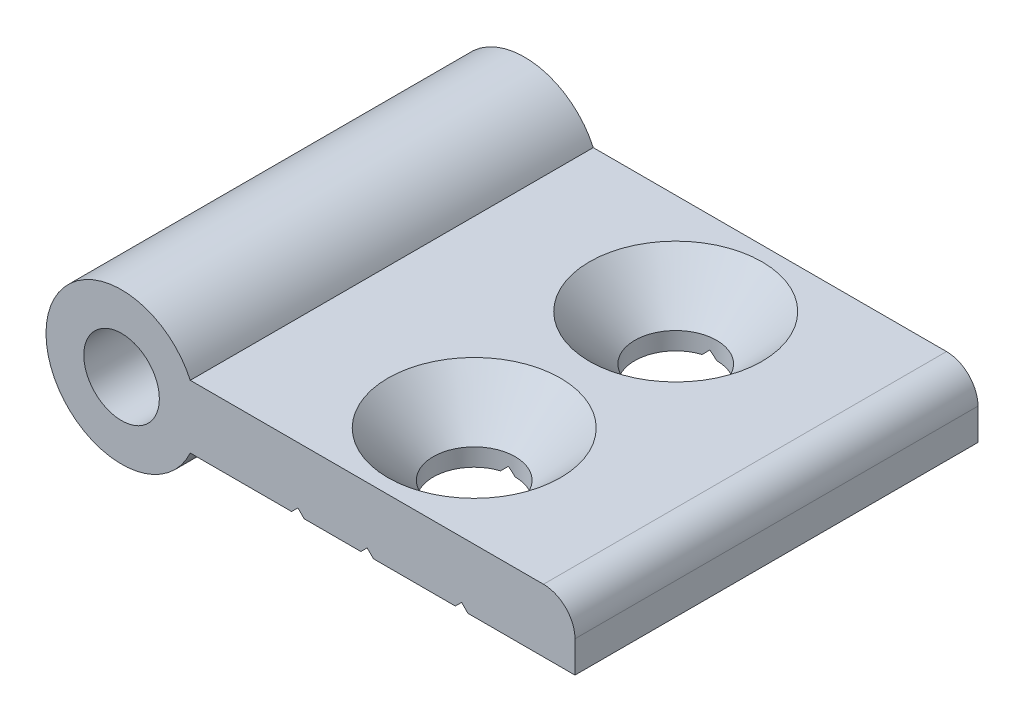
ISO-10303-21;
HEADER;
FILE_DESCRIPTION(('STEP AP214'),'2;1');
FILE_NAME('part.step','',(''),(''),'','','');
FILE_SCHEMA(('AUTOMOTIVE_DESIGN { 1 0 10303 214 1 1 1 1 }'));
ENDSEC;
DATA;
#1=APPLICATION_CONTEXT('core data for automotive mechanical design processes');
#2=APPLICATION_PROTOCOL_DEFINITION('international standard','automotive_design',2000,#1);
#3=PRODUCT_CONTEXT('',#1,'mechanical');
#4=PRODUCT('Part','Part','',(#3));
#5=PRODUCT_RELATED_PRODUCT_CATEGORY('part','',(#4));
#6=PRODUCT_DEFINITION_FORMATION('','',#4);
#7=PRODUCT_DEFINITION_CONTEXT('part definition',#1,'design');
#8=PRODUCT_DEFINITION('design','',#6,#7);
#9=PRODUCT_DEFINITION_SHAPE('','',#8);
#10=(LENGTH_UNIT() NAMED_UNIT(*) SI_UNIT(.MILLI.,.METRE.));
#11=(NAMED_UNIT(*) PLANE_ANGLE_UNIT() SI_UNIT($,.RADIAN.));
#12=(NAMED_UNIT(*) SI_UNIT($,.STERADIAN.) SOLID_ANGLE_UNIT());
#13=UNCERTAINTY_MEASURE_WITH_UNIT(LENGTH_MEASURE(1.E-05),#10,'distance_accuracy_value','');
#14=(GEOMETRIC_REPRESENTATION_CONTEXT(3) GLOBAL_UNCERTAINTY_ASSIGNED_CONTEXT((#13)) GLOBAL_UNIT_ASSIGNED_CONTEXT((#10,
#11,#12)) REPRESENTATION_CONTEXT('',''));
#15=CARTESIAN_POINT('',(0.,0.,0.));
#16=DIRECTION('',(0.,0.,1.));
#17=DIRECTION('',(1.,0.,0.));
#18=AXIS2_PLACEMENT_3D('',#15,#16,#17);
#19=CARTESIAN_POINT('',(19.,-2.5,0.));
#20=DIRECTION('',(0.707106781186547,-0.707106781186548,0.));
#21=DIRECTION('',(0.707106781186548,0.707106781186547,0.));
#22=AXIS2_PLACEMENT_3D('',#19,#20,#21);
#23=PLANE('',#22);
#24=CARTESIAN_POINT('',(20.,-1.5,8.));
#25=DIRECTION('',(0.707106781186547,-0.707106781186548,0.));
#26=DIRECTION('',(-0.707106781186548,-0.707106781186547,0.));
#27=AXIS2_PLACEMENT_3D('',#24,#25,#26);
#28=ELLIPSE('',#27,4.59619407771256,3.25);
#29=CARTESIAN_POINT('',(19.5,-2.,4.78869185533372));
#30=VERTEX_POINT('',#29);
#31=CARTESIAN_POINT('',(19.,-2.5,4.90767078078676));
#32=VERTEX_POINT('',#31);
#33=EDGE_CURVE('E181',#30,#32,#28,.F.);
#34=ORIENTED_EDGE('',*,*,#33,.T.);
#35=DIRECTION('',(0.,0.,-1.));
#36=VECTOR('',#35,1.);
#37=CARTESIAN_POINT('',(19.,-2.5,0.));
#38=LINE('',#37,#36);
#39=CARTESIAN_POINT('',(19.,-2.5,-4.90767078078675));
#40=VERTEX_POINT('',#39);
#41=EDGE_CURVE('E179',#40,#32,#38,.F.);
#42=ORIENTED_EDGE('',*,*,#41,.F.);
#43=CARTESIAN_POINT('',(20.,-1.5,-8.));
#44=DIRECTION('',(0.707106781186547,-0.707106781186548,0.));
#45=DIRECTION('',(-0.707106781186548,-0.707106781186547,0.));
#46=AXIS2_PLACEMENT_3D('',#43,#44,#45);
#47=ELLIPSE('',#46,4.59619407771256,3.25);
#48=CARTESIAN_POINT('',(19.5,-2.,-4.78869185533371));
#49=VERTEX_POINT('',#48);
#50=EDGE_CURVE('E20',#40,#49,#47,.F.);
#51=ORIENTED_EDGE('',*,*,#50,.T.);
#52=DIRECTION('',(0.,0.,1.));
#53=VECTOR('',#52,1.);
#54=CARTESIAN_POINT('',(19.5,-2.,0.));
#55=LINE('',#54,#53);
#56=EDGE_CURVE('E216',#30,#49,#55,.F.);
#57=ORIENTED_EDGE('',*,*,#56,.F.);
#58=EDGE_LOOP('',(#34,#42,#51,#57));
#59=FACE_BOUND('',#58,.T.);
#60=ADVANCED_FACE('F16',(#59),#23,.T.);
#61=CARTESIAN_POINT('',(19.,-2.5,0.));
#62=DIRECTION('',(0.707106781186547,-0.707106781186548,0.));
#63=DIRECTION('',(0.707106781186548,0.707106781186547,0.));
#64=AXIS2_PLACEMENT_3D('',#61,#62,#63);
#65=PLANE('',#64);
#66=DIRECTION('',(0.707106781186548,0.707106781186547,0.));
#67=VECTOR('',#66,1.);
#68=CARTESIAN_POINT('',(19.,-2.5,16.));
#69=LINE('',#68,#67);
#70=CARTESIAN_POINT('',(19.5,-2.,16.));
#71=VERTEX_POINT('',#70);
#72=CARTESIAN_POINT('',(19.,-2.5,16.));
#73=VERTEX_POINT('',#72);
#74=EDGE_CURVE('E329',#71,#73,#69,.F.);
#75=ORIENTED_EDGE('',*,*,#74,.T.);
#76=DIRECTION('',(0.,0.,-1.));
#77=VECTOR('',#76,1.);
#78=CARTESIAN_POINT('',(19.,-2.5,0.));
#79=LINE('',#78,#77);
#80=CARTESIAN_POINT('',(19.,-2.5,11.0923292192132));
#81=VERTEX_POINT('',#80);
#82=EDGE_CURVE('E248',#81,#73,#79,.F.);
#83=ORIENTED_EDGE('',*,*,#82,.F.);
#84=CARTESIAN_POINT('',(20.,-1.5,8.));
#85=DIRECTION('',(0.707106781186547,-0.707106781186548,0.));
#86=DIRECTION('',(-0.707106781186548,-0.707106781186547,0.));
#87=AXIS2_PLACEMENT_3D('',#84,#85,#86);
#88=ELLIPSE('',#87,4.59619407771256,3.25);
#89=CARTESIAN_POINT('',(19.5,-2.,11.2113081446663));
#90=VERTEX_POINT('',#89);
#91=EDGE_CURVE('E204',#81,#90,#88,.F.);
#92=ORIENTED_EDGE('',*,*,#91,.T.);
#93=DIRECTION('',(0.,0.,1.));
#94=VECTOR('',#93,1.);
#95=CARTESIAN_POINT('',(19.5,-2.,0.));
#96=LINE('',#95,#94);
#97=EDGE_CURVE('E289',#71,#90,#96,.F.);
#98=ORIENTED_EDGE('',*,*,#97,.F.);
#99=EDGE_LOOP('',(#75,#83,#92,#98));
#100=FACE_BOUND('',#99,.T.);
#101=ADVANCED_FACE('F513',(#100),#65,.T.);
#102=CARTESIAN_POINT('',(14.,-2.,0.));
#103=DIRECTION('',(-0.707106781186547,-0.707106781186548,0.));
#104=DIRECTION('',(0.707106781186548,-0.707106781186547,0.));
#105=AXIS2_PLACEMENT_3D('',#102,#103,#104);
#106=PLANE('',#105);
#107=DIRECTION('',(0.707106781186548,-0.707106781186547,0.));
#108=VECTOR('',#107,1.);
#109=CARTESIAN_POINT('',(14.,-2.,16.));
#110=LINE('',#109,#108);
#111=CARTESIAN_POINT('',(14.5,-2.5,16.));
#112=VERTEX_POINT('',#111);
#113=CARTESIAN_POINT('',(14.,-2.,16.));
#114=VERTEX_POINT('',#113);
#115=EDGE_CURVE('E323',#112,#114,#110,.F.);
#116=ORIENTED_EDGE('',*,*,#115,.T.);
#117=DIRECTION('',(0.,0.,1.));
#118=VECTOR('',#117,1.);
#119=CARTESIAN_POINT('',(14.,-2.,0.));
#120=LINE('',#119,#118);
#121=CARTESIAN_POINT('',(14.,-2.,-16.));
#122=VERTEX_POINT('',#121);
#123=EDGE_CURVE('E193',#122,#114,#120,.T.);
#124=ORIENTED_EDGE('',*,*,#123,.F.);
#125=DIRECTION('',(0.707106781186548,-0.707106781186547,0.));
#126=VECTOR('',#125,1.);
#127=CARTESIAN_POINT('',(14.,-2.,-16.));
#128=LINE('',#127,#126);
#129=CARTESIAN_POINT('',(14.5,-2.5,-16.));
#130=VERTEX_POINT('',#129);
#131=EDGE_CURVE('E331',#122,#130,#128,.T.);
#132=ORIENTED_EDGE('',*,*,#131,.T.);
#133=DIRECTION('',(0.,0.,-1.));
#134=VECTOR('',#133,1.);
#135=CARTESIAN_POINT('',(14.5,-2.5,0.));
#136=LINE('',#135,#134);
#137=EDGE_CURVE('E245',#112,#130,#136,.T.);
#138=ORIENTED_EDGE('',*,*,#137,.F.);
#139=EDGE_LOOP('',(#116,#124,#132,#138));
#140=FACE_BOUND('',#139,.T.);
#141=ADVANCED_FACE('F545',(#140),#106,.T.);
#142=CARTESIAN_POINT('',(19.,-2.5,0.));
#143=DIRECTION('',(0.707106781186547,-0.707106781186548,0.));
#144=DIRECTION('',(0.707106781186548,0.707106781186547,0.));
#145=AXIS2_PLACEMENT_3D('',#142,#143,#144);
#146=PLANE('',#145);
#147=DIRECTION('',(0.707106781186548,0.707106781186547,0.));
#148=VECTOR('',#147,1.);
#149=CARTESIAN_POINT('',(19.,-2.5,-16.));
#150=LINE('',#149,#148);
#151=CARTESIAN_POINT('',(19.,-2.5,-16.));
#152=VERTEX_POINT('',#151);
#153=CARTESIAN_POINT('',(19.5,-2.,-16.));
#154=VERTEX_POINT('',#153);
#155=EDGE_CURVE('E311',#152,#154,#150,.T.);
#156=ORIENTED_EDGE('',*,*,#155,.T.);
#157=DIRECTION('',(0.,0.,1.));
#158=VECTOR('',#157,1.);
#159=CARTESIAN_POINT('',(19.5,-2.,0.));
#160=LINE('',#159,#158);
#161=CARTESIAN_POINT('',(19.5,-2.,-11.2113081446663));
#162=VERTEX_POINT('',#161);
#163=EDGE_CURVE('E307',#162,#154,#160,.F.);
#164=ORIENTED_EDGE('',*,*,#163,.F.);
#165=CARTESIAN_POINT('',(20.,-1.5,-8.));
#166=DIRECTION('',(0.707106781186547,-0.707106781186548,0.));
#167=DIRECTION('',(-0.707106781186548,-0.707106781186547,0.));
#168=AXIS2_PLACEMENT_3D('',#165,#166,#167);
#169=ELLIPSE('',#168,4.59619407771256,3.25);
#170=CARTESIAN_POINT('',(19.,-2.5,-11.0923292192132));
#171=VERTEX_POINT('',#170);
#172=EDGE_CURVE('E206',#162,#171,#169,.F.);
#173=ORIENTED_EDGE('',*,*,#172,.T.);
#174=DIRECTION('',(0.,0.,-1.));
#175=VECTOR('',#174,1.);
#176=CARTESIAN_POINT('',(19.,-2.5,0.));
#177=LINE('',#176,#175);
#178=EDGE_CURVE('E190',#152,#171,#177,.F.);
#179=ORIENTED_EDGE('',*,*,#178,.F.);
#180=EDGE_LOOP('',(#156,#164,#173,#179));
#181=FACE_BOUND('',#180,.T.);
#182=ADVANCED_FACE('F541',(#181),#146,.T.);
#183=CARTESIAN_POINT('',(19.5,-2.,0.));
#184=DIRECTION('',(-0.707106781186546,-0.707106781186549,0.));
#185=DIRECTION('',(0.707106781186549,-0.707106781186546,0.));
#186=AXIS2_PLACEMENT_3D('',#183,#184,#185);
#187=PLANE('',#186);
#188=DIRECTION('',(0.707106781186549,-0.707106781186546,0.));
#189=VECTOR('',#188,1.);
#190=CARTESIAN_POINT('',(19.5,-2.,-16.));
#191=LINE('',#190,#189);
#192=CARTESIAN_POINT('',(20.,-2.5,-16.));
#193=VERTEX_POINT('',#192);
#194=EDGE_CURVE('E310',#154,#193,#191,.T.);
#195=ORIENTED_EDGE('',*,*,#194,.T.);
#196=DIRECTION('',(0.,0.,-1.));
#197=VECTOR('',#196,1.);
#198=CARTESIAN_POINT('',(20.,-2.5,0.));
#199=LINE('',#198,#197);
#200=CARTESIAN_POINT('',(20.,-2.5,-11.25));
#201=VERTEX_POINT('',#200);
#202=EDGE_CURVE('E222',#201,#193,#199,.T.);
#203=ORIENTED_EDGE('',*,*,#202,.F.);
#204=CARTESIAN_POINT('',(20.,-2.5,-8.));
#205=DIRECTION('',(-0.707106781186546,-0.707106781186549,0.));
#206=DIRECTION('',(0.707106781186549,-0.707106781186546,0.));
#207=AXIS2_PLACEMENT_3D('',#204,#205,#206);
#208=ELLIPSE('',#207,4.59619407771255,3.25);
#209=EDGE_CURVE('E208',#201,#162,#208,.F.);
#210=ORIENTED_EDGE('',*,*,#209,.T.);
#211=ORIENTED_EDGE('',*,*,#163,.T.);
#212=EDGE_LOOP('',(#195,#203,#210,#211));
#213=FACE_BOUND('',#212,.T.);
#214=ADVANCED_FACE('F538',(#213),#187,.T.);
#215=CARTESIAN_POINT('',(26.5,-2.5,0.));
#216=DIRECTION('',(0.707106781186549,-0.707106781186546,0.));
#217=DIRECTION('',(0.707106781186546,0.707106781186549,0.));
#218=AXIS2_PLACEMENT_3D('',#215,#216,#217);
#219=PLANE('',#218);
#220=DIRECTION('',(0.707106781186546,0.707106781186549,0.));
#221=VECTOR('',#220,1.);
#222=CARTESIAN_POINT('',(26.5,-2.5,16.));
#223=LINE('',#222,#221);
#224=CARTESIAN_POINT('',(27.,-2.,16.));
#225=VERTEX_POINT('',#224);
#226=CARTESIAN_POINT('',(26.5,-2.5,16.));
#227=VERTEX_POINT('',#226);
#228=EDGE_CURVE('E297',#225,#227,#223,.F.);
#229=ORIENTED_EDGE('',*,*,#228,.T.);
#230=DIRECTION('',(0.,0.,-1.));
#231=VECTOR('',#230,1.);
#232=CARTESIAN_POINT('',(26.5,-2.5,0.));
#233=LINE('',#232,#231);
#234=CARTESIAN_POINT('',(26.5,-2.5,-16.));
#235=VERTEX_POINT('',#234);
#236=EDGE_CURVE('E238',#235,#227,#233,.F.);
#237=ORIENTED_EDGE('',*,*,#236,.F.);
#238=DIRECTION('',(0.707106781186546,0.707106781186549,0.));
#239=VECTOR('',#238,1.);
#240=CARTESIAN_POINT('',(26.5,-2.5,-16.));
#241=LINE('',#240,#239);
#242=CARTESIAN_POINT('',(27.,-2.,-16.));
#243=VERTEX_POINT('',#242);
#244=EDGE_CURVE('E315',#235,#243,#241,.T.);
#245=ORIENTED_EDGE('',*,*,#244,.T.);
#246=DIRECTION('',(0.,0.,1.));
#247=VECTOR('',#246,1.);
#248=CARTESIAN_POINT('',(27.,-2.,0.));
#249=LINE('',#248,#247);
#250=EDGE_CURVE('E177',#225,#243,#249,.F.);
#251=ORIENTED_EDGE('',*,*,#250,.F.);
#252=EDGE_LOOP('',(#229,#237,#245,#251));
#253=FACE_BOUND('',#252,.T.);
#254=ADVANCED_FACE('F520',(#253),#219,.T.);
#255=CARTESIAN_POINT('',(19.5,-2.,0.));
#256=DIRECTION('',(-0.707106781186546,-0.707106781186549,0.));
#257=DIRECTION('',(0.707106781186549,-0.707106781186546,0.));
#258=AXIS2_PLACEMENT_3D('',#255,#256,#257);
#259=PLANE('',#258);
#260=DIRECTION('',(0.707106781186549,-0.707106781186546,0.));
#261=VECTOR('',#260,1.);
#262=CARTESIAN_POINT('',(19.5,-2.,16.));
#263=LINE('',#262,#261);
#264=CARTESIAN_POINT('',(20.,-2.5,16.));
#265=VERTEX_POINT('',#264);
#266=EDGE_CURVE('E292',#265,#71,#263,.F.);
#267=ORIENTED_EDGE('',*,*,#266,.T.);
#268=ORIENTED_EDGE('',*,*,#97,.T.);
#269=CARTESIAN_POINT('',(20.,-2.5,8.));
#270=DIRECTION('',(-0.707106781186546,-0.707106781186549,0.));
#271=DIRECTION('',(0.707106781186549,-0.707106781186546,0.));
#272=AXIS2_PLACEMENT_3D('',#269,#270,#271);
#273=ELLIPSE('',#272,4.59619407771255,3.25);
#274=CARTESIAN_POINT('',(20.,-2.5,11.25));
#275=VERTEX_POINT('',#274);
#276=EDGE_CURVE('E202',#90,#275,#273,.F.);
#277=ORIENTED_EDGE('',*,*,#276,.T.);
#278=DIRECTION('',(0.,0.,-1.));
#279=VECTOR('',#278,1.);
#280=CARTESIAN_POINT('',(20.,-2.5,0.));
#281=LINE('',#280,#279);
#282=EDGE_CURVE('E232',#265,#275,#281,.T.);
#283=ORIENTED_EDGE('',*,*,#282,.F.);
#284=EDGE_LOOP('',(#267,#268,#277,#283));
#285=FACE_BOUND('',#284,.T.);
#286=ADVANCED_FACE('F515',(#285),#259,.T.);
#287=CARTESIAN_POINT('',(19.5,-2.,0.));
#288=DIRECTION('',(-0.707106781186546,-0.707106781186549,0.));
#289=DIRECTION('',(0.707106781186549,-0.707106781186546,0.));
#290=AXIS2_PLACEMENT_3D('',#287,#288,#289);
#291=PLANE('',#290);
#292=CARTESIAN_POINT('',(20.,-2.5,8.));
#293=DIRECTION('',(-0.707106781186546,-0.707106781186549,0.));
#294=DIRECTION('',(0.707106781186549,-0.707106781186546,0.));
#295=AXIS2_PLACEMENT_3D('',#292,#293,#294);
#296=ELLIPSE('',#295,4.59619407771255,3.25);
#297=CARTESIAN_POINT('',(20.,-2.5,4.75));
#298=VERTEX_POINT('',#297);
#299=EDGE_CURVE('E199',#298,#30,#296,.F.);
#300=ORIENTED_EDGE('',*,*,#299,.T.);
#301=ORIENTED_EDGE('',*,*,#56,.T.);
#302=CARTESIAN_POINT('',(20.,-2.5,-8.));
#303=DIRECTION('',(-0.707106781186546,-0.707106781186549,0.));
#304=DIRECTION('',(0.707106781186549,-0.707106781186546,0.));
#305=AXIS2_PLACEMENT_3D('',#302,#303,#304);
#306=ELLIPSE('',#305,4.59619407771255,3.25);
#307=CARTESIAN_POINT('',(20.,-2.5,-4.75));
#308=VERTEX_POINT('',#307);
#309=EDGE_CURVE('E174',#49,#308,#306,.F.);
#310=ORIENTED_EDGE('',*,*,#309,.T.);
#311=DIRECTION('',(0.,0.,-1.));
#312=VECTOR('',#311,1.);
#313=CARTESIAN_POINT('',(20.,-2.5,0.));
#314=LINE('',#313,#312);
#315=EDGE_CURVE('E214',#298,#308,#314,.T.);
#316=ORIENTED_EDGE('',*,*,#315,.F.);
#317=EDGE_LOOP('',(#300,#301,#310,#316));
#318=FACE_BOUND('',#317,.T.);
#319=ADVANCED_FACE('F212',(#318),#291,.T.);
#320=CARTESIAN_POINT('',(27.,-2.,0.));
#321=DIRECTION('',(-0.707106781186549,-0.707106781186546,0.));
#322=DIRECTION('',(0.707106781186546,-0.707106781186549,0.));
#323=AXIS2_PLACEMENT_3D('',#320,#321,#322);
#324=PLANE('',#323);
#325=DIRECTION('',(0.707106781186546,-0.707106781186549,0.));
#326=VECTOR('',#325,1.);
#327=CARTESIAN_POINT('',(27.,-2.,16.));
#328=LINE('',#327,#326);
#329=CARTESIAN_POINT('',(27.5,-2.5,16.));
#330=VERTEX_POINT('',#329);
#331=EDGE_CURVE('E279',#330,#225,#328,.F.);
#332=ORIENTED_EDGE('',*,*,#331,.T.);
#333=ORIENTED_EDGE('',*,*,#250,.T.);
#334=DIRECTION('',(0.707106781186546,-0.707106781186549,0.));
#335=VECTOR('',#334,1.);
#336=CARTESIAN_POINT('',(27.,-2.,-16.));
#337=LINE('',#336,#335);
#338=CARTESIAN_POINT('',(27.5,-2.5,-16.));
#339=VERTEX_POINT('',#338);
#340=EDGE_CURVE('E282',#243,#339,#337,.T.);
#341=ORIENTED_EDGE('',*,*,#340,.T.);
#342=DIRECTION('',(0.,0.,-1.));
#343=VECTOR('',#342,1.);
#344=CARTESIAN_POINT('',(27.5,-2.5,0.));
#345=LINE('',#344,#343);
#346=EDGE_CURVE('E227',#330,#339,#345,.T.);
#347=ORIENTED_EDGE('',*,*,#346,.F.);
#348=EDGE_LOOP('',(#332,#333,#341,#347));
#349=FACE_BOUND('',#348,.T.);
#350=ADVANCED_FACE('F522',(#349),#324,.T.);
#351=CARTESIAN_POINT('',(20.,-1.09999999999999,-8.));
#352=DIRECTION('',(0.,-1.,0.));
#353=DIRECTION('',(0.,0.,-1.));
#354=AXIS2_PLACEMENT_3D('',#351,#352,#353);
#355=CYLINDRICAL_SURFACE('',#354,3.25);
#356=CARTESIAN_POINT('',(20.,-1.1,-8.));
#357=DIRECTION('',(0.,1.,0.));
#358=DIRECTION('',(0.,0.,1.));
#359=AXIS2_PLACEMENT_3D('',#356,#357,#358);
#360=CIRCLE('',#359,3.25);
#361=CARTESIAN_POINT('',(23.25,-1.1,-8.));
#362=VERTEX_POINT('',#361);
#363=EDGE_CURVE('E33',#362,#362,#360,.T.);
#364=ORIENTED_EDGE('',*,*,#363,.T.);
#365=EDGE_LOOP('',(#364));
#366=FACE_BOUND('',#365,.T.);
#367=ORIENTED_EDGE('',*,*,#172,.F.);
#368=ORIENTED_EDGE('',*,*,#209,.F.);
#369=CARTESIAN_POINT('',(20.,-2.5,-8.));
#370=DIRECTION('',(0.,-1.,0.));
#371=DIRECTION('',(0.,0.,-1.));
#372=AXIS2_PLACEMENT_3D('',#369,#370,#371);
#373=CIRCLE('',#372,3.25);
#374=EDGE_CURVE('E218',#308,#201,#373,.F.);
#375=ORIENTED_EDGE('',*,*,#374,.F.);
#376=ORIENTED_EDGE('',*,*,#309,.F.);
#377=ORIENTED_EDGE('',*,*,#50,.F.);
#378=CARTESIAN_POINT('',(20.,-2.5,-8.));
#379=DIRECTION('',(0.,-1.,0.));
#380=DIRECTION('',(0.,0.,-1.));
#381=AXIS2_PLACEMENT_3D('',#378,#379,#380);
#382=CIRCLE('',#381,3.25);
#383=EDGE_CURVE('E171',#171,#40,#382,.F.);
#384=ORIENTED_EDGE('',*,*,#383,.F.);
#385=EDGE_LOOP('',(#367,#368,#375,#376,#377,#384));
#386=FACE_BOUND('',#385,.T.);
#387=ADVANCED_FACE('F169',(#366,#386),#355,.F.);
#388=CARTESIAN_POINT('',(20.,-1.09999999999999,8.));
#389=DIRECTION('',(0.,-1.,0.));
#390=DIRECTION('',(0.,0.,-1.));
#391=AXIS2_PLACEMENT_3D('',#388,#389,#390);
#392=CYLINDRICAL_SURFACE('',#391,3.25);
#393=CARTESIAN_POINT('',(20.,-1.1,8.));
#394=DIRECTION('',(0.,1.,0.));
#395=DIRECTION('',(0.,0.,1.));
#396=AXIS2_PLACEMENT_3D('',#393,#394,#395);
#397=CIRCLE('',#396,3.25);
#398=CARTESIAN_POINT('',(23.25,-1.1,8.));
#399=VERTEX_POINT('',#398);
#400=EDGE_CURVE('E266',#399,#399,#397,.T.);
#401=ORIENTED_EDGE('',*,*,#400,.T.);
#402=EDGE_LOOP('',(#401));
#403=FACE_BOUND('',#402,.T.);
#404=ORIENTED_EDGE('',*,*,#33,.F.);
#405=ORIENTED_EDGE('',*,*,#299,.F.);
#406=CARTESIAN_POINT('',(20.,-2.5,8.));
#407=DIRECTION('',(0.,-1.,0.));
#408=DIRECTION('',(0.,0.,-1.));
#409=AXIS2_PLACEMENT_3D('',#406,#407,#408);
#410=CIRCLE('',#409,3.25);
#411=EDGE_CURVE('E226',#275,#298,#410,.F.);
#412=ORIENTED_EDGE('',*,*,#411,.F.);
#413=ORIENTED_EDGE('',*,*,#276,.F.);
#414=ORIENTED_EDGE('',*,*,#91,.F.);
#415=CARTESIAN_POINT('',(20.,-2.5,8.));
#416=DIRECTION('',(0.,-1.,0.));
#417=DIRECTION('',(0.,0.,-1.));
#418=AXIS2_PLACEMENT_3D('',#415,#416,#417);
#419=CIRCLE('',#418,3.25);
#420=EDGE_CURVE('E185',#32,#81,#419,.F.);
#421=ORIENTED_EDGE('',*,*,#420,.F.);
#422=EDGE_LOOP('',(#404,#405,#412,#413,#414,#421));
#423=FACE_BOUND('',#422,.T.);
#424=ADVANCED_FACE('F503',(#403,#423),#392,.F.);
#425=CARTESIAN_POINT('',(13.5,-2.5,0.));
#426=DIRECTION('',(0.707106781186547,-0.707106781186548,0.));
#427=DIRECTION('',(0.707106781186548,0.707106781186547,0.));
#428=AXIS2_PLACEMENT_3D('',#425,#426,#427);
#429=PLANE('',#428);
#430=DIRECTION('',(0.707106781186548,0.707106781186547,0.));
#431=VECTOR('',#430,1.);
#432=CARTESIAN_POINT('',(13.5,-2.5,16.));
#433=LINE('',#432,#431);
#434=CARTESIAN_POINT('',(13.5,-2.5,16.));
#435=VERTEX_POINT('',#434);
#436=EDGE_CURVE('E191',#114,#435,#433,.F.);
#437=ORIENTED_EDGE('',*,*,#436,.T.);
#438=DIRECTION('',(0.,0.,-1.));
#439=VECTOR('',#438,1.);
#440=CARTESIAN_POINT('',(13.5,-2.5,0.));
#441=LINE('',#440,#439);
#442=CARTESIAN_POINT('',(13.5,-2.5,-16.));
#443=VERTEX_POINT('',#442);
#444=EDGE_CURVE('E253',#443,#435,#441,.F.);
#445=ORIENTED_EDGE('',*,*,#444,.F.);
#446=DIRECTION('',(0.707106781186549,0.707106781186546,0.));
#447=VECTOR('',#446,1.);
#448=CARTESIAN_POINT('',(13.5,-2.5,-16.));
#449=LINE('',#448,#447);
#450=EDGE_CURVE('E262',#443,#122,#449,.T.);
#451=ORIENTED_EDGE('',*,*,#450,.T.);
#452=ORIENTED_EDGE('',*,*,#123,.T.);
#453=EDGE_LOOP('',(#437,#445,#451,#452));
#454=FACE_BOUND('',#453,.T.);
#455=ADVANCED_FACE('F446',(#454),#429,.T.);
#456=CARTESIAN_POINT('',(14.5,-2.5,0.));
#457=DIRECTION('',(0.,-1.,0.));
#458=DIRECTION('',(0.,0.,-1.));
#459=AXIS2_PLACEMENT_3D('',#456,#457,#458);
#460=PLANE('',#459);
#461=DIRECTION('',(1.,0.,0.));
#462=VECTOR('',#461,1.);
#463=CARTESIAN_POINT('',(14.3886766748367,-2.5,-16.));
#464=LINE('',#463,#462);
#465=EDGE_CURVE('E265',#130,#152,#464,.T.);
#466=ORIENTED_EDGE('',*,*,#465,.T.);
#467=ORIENTED_EDGE('',*,*,#178,.T.);
#468=ORIENTED_EDGE('',*,*,#383,.T.);
#469=ORIENTED_EDGE('',*,*,#41,.T.);
#470=ORIENTED_EDGE('',*,*,#420,.T.);
#471=ORIENTED_EDGE('',*,*,#82,.T.);
#472=DIRECTION('',(1.,0.,0.));
#473=VECTOR('',#472,1.);
#474=CARTESIAN_POINT('',(14.3886766748367,-2.5,16.));
#475=LINE('',#474,#473);
#476=EDGE_CURVE('E304',#112,#73,#475,.T.);
#477=ORIENTED_EDGE('',*,*,#476,.F.);
#478=ORIENTED_EDGE('',*,*,#137,.T.);
#479=EDGE_LOOP('',(#466,#467,#468,#469,#470,#471,#477,#478));
#480=FACE_BOUND('',#479,.T.);
#481=ADVANCED_FACE('F188',(#480),#460,.T.);
#482=CARTESIAN_POINT('',(20.,-2.5,0.));
#483=DIRECTION('',(0.,-1.,0.));
#484=DIRECTION('',(0.,0.,-1.));
#485=AXIS2_PLACEMENT_3D('',#482,#483,#484);
#486=PLANE('',#485);
#487=ORIENTED_EDGE('',*,*,#411,.T.);
#488=ORIENTED_EDGE('',*,*,#315,.T.);
#489=ORIENTED_EDGE('',*,*,#374,.T.);
#490=ORIENTED_EDGE('',*,*,#202,.T.);
#491=DIRECTION('',(1.,0.,0.));
#492=VECTOR('',#491,1.);
#493=CARTESIAN_POINT('',(14.3886766748367,-2.5,-16.));
#494=LINE('',#493,#492);
#495=EDGE_CURVE('E272',#193,#235,#494,.T.);
#496=ORIENTED_EDGE('',*,*,#495,.T.);
#497=ORIENTED_EDGE('',*,*,#236,.T.);
#498=DIRECTION('',(1.,0.,0.));
#499=VECTOR('',#498,1.);
#500=CARTESIAN_POINT('',(14.3886766748367,-2.5,16.));
#501=LINE('',#500,#499);
#502=EDGE_CURVE('E300',#265,#227,#501,.T.);
#503=ORIENTED_EDGE('',*,*,#502,.F.);
#504=ORIENTED_EDGE('',*,*,#282,.T.);
#505=EDGE_LOOP('',(#487,#488,#489,#490,#496,#497,#503,#504));
#506=FACE_BOUND('',#505,.T.);
#507=ADVANCED_FACE('F223',(#506),#486,.T.);
#508=CARTESIAN_POINT('',(27.5,-2.5,0.));
#509=DIRECTION('',(0.,-1.,0.));
#510=DIRECTION('',(0.,0.,-1.));
#511=AXIS2_PLACEMENT_3D('',#508,#509,#510);
#512=PLANE('',#511);
#513=DIRECTION('',(1.,0.,0.));
#514=VECTOR('',#513,1.);
#515=CARTESIAN_POINT('',(14.3886766748367,-2.5,16.));
#516=LINE('',#515,#514);
#517=CARTESIAN_POINT('',(36.,-2.5,16.));
#518=VERTEX_POINT('',#517);
#519=EDGE_CURVE('E303',#330,#518,#516,.T.);
#520=ORIENTED_EDGE('',*,*,#519,.F.);
#521=ORIENTED_EDGE('',*,*,#346,.T.);
#522=DIRECTION('',(1.,0.,0.));
#523=VECTOR('',#522,1.);
#524=CARTESIAN_POINT('',(14.3886766748367,-2.5,-16.));
#525=LINE('',#524,#523);
#526=CARTESIAN_POINT('',(36.,-2.5,-16.));
#527=VERTEX_POINT('',#526);
#528=EDGE_CURVE('E269',#339,#527,#525,.T.);
#529=ORIENTED_EDGE('',*,*,#528,.T.);
#530=DIRECTION('',(0.,0.,-1.));
#531=VECTOR('',#530,1.);
#532=CARTESIAN_POINT('',(36.,-2.5,0.));
#533=LINE('',#532,#531);
#534=EDGE_CURVE('E230',#518,#527,#533,.T.);
#535=ORIENTED_EDGE('',*,*,#534,.F.);
#536=EDGE_LOOP('',(#520,#521,#529,#535));
#537=FACE_BOUND('',#536,.T.);
#538=ADVANCED_FACE('F458',(#537),#512,.T.);
#539=CARTESIAN_POINT('',(36.,-2.5,0.));
#540=DIRECTION('',(1.,0.,0.));
#541=DIRECTION('',(0.,0.,-1.));
#542=AXIS2_PLACEMENT_3D('',#539,#540,#541);
#543=PLANE('',#542);
#544=DIRECTION('',(0.,1.,0.));
#545=VECTOR('',#544,1.);
#546=CARTESIAN_POINT('',(36.,-0.053688417283162,16.));
#547=LINE('',#546,#545);
#548=CARTESIAN_POINT('',(36.,0.,16.));
#549=VERTEX_POINT('',#548);
#550=EDGE_CURVE('E382',#518,#549,#547,.T.);
#551=ORIENTED_EDGE('',*,*,#550,.F.);
#552=ORIENTED_EDGE('',*,*,#534,.T.);
#553=DIRECTION('',(0.,1.,0.));
#554=VECTOR('',#553,1.);
#555=CARTESIAN_POINT('',(36.,-0.053688417283162,-16.));
#556=LINE('',#555,#554);
#557=CARTESIAN_POINT('',(36.,0.,-16.));
#558=VERTEX_POINT('',#557);
#559=EDGE_CURVE('E271',#527,#558,#556,.T.);
#560=ORIENTED_EDGE('',*,*,#559,.T.);
#561=DIRECTION('',(0.,0.,-1.));
#562=VECTOR('',#561,1.);
#563=CARTESIAN_POINT('',(36.,0.,0.));
#564=LINE('',#563,#562);
#565=EDGE_CURVE('E408',#549,#558,#564,.T.);
#566=ORIENTED_EDGE('',*,*,#565,.F.);
#567=EDGE_LOOP('',(#551,#552,#560,#566));
#568=FACE_BOUND('',#567,.T.);
#569=ADVANCED_FACE('F460',(#568),#543,.T.);
#570=CARTESIAN_POINT('',(0.,0.,0.));
#571=DIRECTION('',(0.,0.,-1.));
#572=DIRECTION('',(-1.,0.,0.));
#573=AXIS2_PLACEMENT_3D('',#570,#571,#572);
#574=CYLINDRICAL_SURFACE('',#573,3.);
#575=CARTESIAN_POINT('',(0.,0.,-16.));
#576=DIRECTION('',(0.,0.,-1.));
#577=DIRECTION('',(-1.,0.,0.));
#578=AXIS2_PLACEMENT_3D('',#575,#576,#577);
#579=CIRCLE('',#578,3.);
#580=CARTESIAN_POINT('',(3.,0.,-16.));
#581=VERTEX_POINT('',#580);
#582=EDGE_CURVE('E383',#581,#581,#579,.T.);
#583=ORIENTED_EDGE('',*,*,#582,.T.);
#584=EDGE_LOOP('',(#583));
#585=FACE_BOUND('',#584,.T.);
#586=CARTESIAN_POINT('',(0.,0.,16.));
#587=DIRECTION('',(0.,0.,-1.));
#588=DIRECTION('',(-1.,0.,0.));
#589=AXIS2_PLACEMENT_3D('',#586,#587,#588);
#590=CIRCLE('',#589,3.);
#591=CARTESIAN_POINT('',(3.,0.,16.));
#592=VERTEX_POINT('',#591);
#593=EDGE_CURVE('E376',#592,#592,#590,.T.);
#594=ORIENTED_EDGE('',*,*,#593,.F.);
#595=EDGE_LOOP('',(#594));
#596=FACE_BOUND('',#595,.T.);
#597=ADVANCED_FACE('F465',(#585,#596),#574,.F.);
#598=CARTESIAN_POINT('',(33.5,0.,0.));
#599=DIRECTION('',(0.,0.,-1.));
#600=DIRECTION('',(-1.,0.,0.));
#601=AXIS2_PLACEMENT_3D('',#598,#599,#600);
#602=CYLINDRICAL_SURFACE('',#601,2.5);
#603=CARTESIAN_POINT('',(33.5,0.,16.));
#604=DIRECTION('',(0.,0.,-1.));
#605=DIRECTION('',(-1.,0.,0.));
#606=AXIS2_PLACEMENT_3D('',#603,#604,#605);
#607=CIRCLE('',#606,2.5);
#608=CARTESIAN_POINT('',(33.5,2.5,16.));
#609=VERTEX_POINT('',#608);
#610=EDGE_CURVE('E380',#549,#609,#607,.F.);
#611=ORIENTED_EDGE('',*,*,#610,.F.);
#612=ORIENTED_EDGE('',*,*,#565,.T.);
#613=CARTESIAN_POINT('',(33.5,0.,-16.));
#614=DIRECTION('',(0.,0.,-1.));
#615=DIRECTION('',(-1.,0.,0.));
#616=AXIS2_PLACEMENT_3D('',#613,#614,#615);
#617=CIRCLE('',#616,2.5);
#618=CARTESIAN_POINT('',(33.5,2.5,-16.));
#619=VERTEX_POINT('',#618);
#620=EDGE_CURVE('E385',#558,#619,#617,.F.);
#621=ORIENTED_EDGE('',*,*,#620,.T.);
#622=DIRECTION('',(0.,0.,1.));
#623=VECTOR('',#622,1.);
#624=CARTESIAN_POINT('',(33.5,2.5,0.));
#625=LINE('',#624,#623);
#626=EDGE_CURVE('E375',#609,#619,#625,.F.);
#627=ORIENTED_EDGE('',*,*,#626,.F.);
#628=EDGE_LOOP('',(#611,#612,#621,#627));
#629=FACE_BOUND('',#628,.T.);
#630=ADVANCED_FACE('F462',(#629),#602,.T.);
#631=CARTESIAN_POINT('',(20.,2.5,-8.));
#632=DIRECTION('',(0.,1.,0.));
#633=DIRECTION('',(0.,0.,1.));
#634=AXIS2_PLACEMENT_3D('',#631,#632,#633);
#635=CONICAL_SURFACE('',#634,6.85,0.785398163397448);
#636=ORIENTED_EDGE('',*,*,#363,.F.);
#637=EDGE_LOOP('',(#636));
#638=FACE_BOUND('',#637,.T.);
#639=CARTESIAN_POINT('',(20.,2.5,-8.));
#640=DIRECTION('',(0.,1.,0.));
#641=DIRECTION('',(0.,0.,1.));
#642=AXIS2_PLACEMENT_3D('',#639,#640,#641);
#643=CIRCLE('',#642,6.85);
#644=CARTESIAN_POINT('',(26.85,2.5,-8.));
#645=VERTEX_POINT('',#644);
#646=EDGE_CURVE('E372',#645,#645,#643,.F.);
#647=ORIENTED_EDGE('',*,*,#646,.F.);
#648=EDGE_LOOP('',(#647));
#649=FACE_BOUND('',#648,.T.);
#650=ADVANCED_FACE('F464',(#638,#649),#635,.F.);
#651=CARTESIAN_POINT('',(20.,2.5,8.));
#652=DIRECTION('',(0.,1.,0.));
#653=DIRECTION('',(0.,0.,1.));
#654=AXIS2_PLACEMENT_3D('',#651,#652,#653);
#655=CONICAL_SURFACE('',#654,6.85,0.785398163397448);
#656=ORIENTED_EDGE('',*,*,#400,.F.);
#657=EDGE_LOOP('',(#656));
#658=FACE_BOUND('',#657,.T.);
#659=CARTESIAN_POINT('',(20.,2.5,8.));
#660=DIRECTION('',(0.,1.,0.));
#661=DIRECTION('',(0.,0.,1.));
#662=AXIS2_PLACEMENT_3D('',#659,#660,#661);
#663=CIRCLE('',#662,6.85);
#664=CARTESIAN_POINT('',(26.85,2.5,8.));
#665=VERTEX_POINT('',#664);
#666=EDGE_CURVE('E369',#665,#665,#663,.F.);
#667=ORIENTED_EDGE('',*,*,#666,.F.);
#668=EDGE_LOOP('',(#667));
#669=FACE_BOUND('',#668,.T.);
#670=ADVANCED_FACE('F18',(#658,#669),#655,.F.);
#671=CARTESIAN_POINT('',(14.3886766748367,-0.053688417283162,-16.));
#672=DIRECTION('',(0.,0.,1.));
#673=DIRECTION('',(1.,0.,0.));
#674=AXIS2_PLACEMENT_3D('',#671,#672,#673);
#675=PLANE('',#674);
#676=ORIENTED_EDGE('',*,*,#582,.F.);
#677=EDGE_LOOP('',(#676));
#678=FACE_BOUND('',#677,.T.);
#679=CARTESIAN_POINT('',(0.,0.,-16.));
#680=DIRECTION('',(0.,0.,-1.));
#681=DIRECTION('',(-1.,0.,0.));
#682=AXIS2_PLACEMENT_3D('',#679,#680,#681);
#683=CIRCLE('',#682,6.);
#684=CARTESIAN_POINT('',(5.45435605731786,2.5,-16.));
#685=VERTEX_POINT('',#684);
#686=CARTESIAN_POINT('',(5.45435605731786,-2.5,-16.));
#687=VERTEX_POINT('',#686);
#688=EDGE_CURVE('E366',#685,#687,#683,.F.);
#689=ORIENTED_EDGE('',*,*,#688,.F.);
#690=DIRECTION('',(1.,0.,0.));
#691=VECTOR('',#690,1.);
#692=CARTESIAN_POINT('',(33.5,2.5,-16.));
#693=LINE('',#692,#691);
#694=EDGE_CURVE('E379',#619,#685,#693,.F.);
#695=ORIENTED_EDGE('',*,*,#694,.F.);
#696=ORIENTED_EDGE('',*,*,#620,.F.);
#697=ORIENTED_EDGE('',*,*,#559,.F.);
#698=ORIENTED_EDGE('',*,*,#528,.F.);
#699=ORIENTED_EDGE('',*,*,#340,.F.);
#700=ORIENTED_EDGE('',*,*,#244,.F.);
#701=ORIENTED_EDGE('',*,*,#495,.F.);
#702=ORIENTED_EDGE('',*,*,#194,.F.);
#703=ORIENTED_EDGE('',*,*,#155,.F.);
#704=ORIENTED_EDGE('',*,*,#465,.F.);
#705=ORIENTED_EDGE('',*,*,#131,.F.);
#706=ORIENTED_EDGE('',*,*,#450,.F.);
#707=DIRECTION('',(1.,0.,0.));
#708=VECTOR('',#707,1.);
#709=CARTESIAN_POINT('',(5.45435605731786,-2.5,-16.));
#710=LINE('',#709,#708);
#711=EDGE_CURVE('E257',#687,#443,#710,.T.);
#712=ORIENTED_EDGE('',*,*,#711,.F.);
#713=EDGE_LOOP('',(#689,#695,#696,#697,#698,#699,#700,#701,#702,#703,#704,#705,#706,#712));
#714=FACE_BOUND('',#713,.T.);
#715=ADVANCED_FACE('F442',(#678,#714),#675,.F.);
#716=CARTESIAN_POINT('',(5.45435605731786,-2.5,0.));
#717=DIRECTION('',(0.,-1.,0.));
#718=DIRECTION('',(0.,0.,-1.));
#719=AXIS2_PLACEMENT_3D('',#716,#717,#718);
#720=PLANE('',#719);
#721=DIRECTION('',(1.,0.,0.));
#722=VECTOR('',#721,1.);
#723=CARTESIAN_POINT('',(14.3886766748367,-2.5,16.));
#724=LINE('',#723,#722);
#725=CARTESIAN_POINT('',(5.45435605731786,-2.5,16.));
#726=VERTEX_POINT('',#725);
#727=EDGE_CURVE('E256',#726,#435,#724,.T.);
#728=ORIENTED_EDGE('',*,*,#727,.F.);
#729=DIRECTION('',(0.,0.,-1.));
#730=VECTOR('',#729,1.);
#731=CARTESIAN_POINT('',(5.45435605731786,-2.5,0.));
#732=LINE('',#731,#730);
#733=EDGE_CURVE('E365',#687,#726,#732,.F.);
#734=ORIENTED_EDGE('',*,*,#733,.F.);
#735=ORIENTED_EDGE('',*,*,#711,.T.);
#736=ORIENTED_EDGE('',*,*,#444,.T.);
#737=EDGE_LOOP('',(#728,#734,#735,#736));
#738=FACE_BOUND('',#737,.T.);
#739=ADVANCED_FACE('F438',(#738),#720,.T.);
#740=CARTESIAN_POINT('',(14.3886766748367,-0.053688417283162,16.));
#741=DIRECTION('',(0.,0.,1.));
#742=DIRECTION('',(1.,0.,0.));
#743=AXIS2_PLACEMENT_3D('',#740,#741,#742);
#744=PLANE('',#743);
#745=ORIENTED_EDGE('',*,*,#593,.T.);
#746=EDGE_LOOP('',(#745));
#747=FACE_BOUND('',#746,.T.);
#748=ORIENTED_EDGE('',*,*,#550,.T.);
#749=ORIENTED_EDGE('',*,*,#610,.T.);
#750=DIRECTION('',(1.,0.,0.));
#751=VECTOR('',#750,1.);
#752=CARTESIAN_POINT('',(33.5,2.5,16.));
#753=LINE('',#752,#751);
#754=CARTESIAN_POINT('',(5.45435605731786,2.5,16.));
#755=VERTEX_POINT('',#754);
#756=EDGE_CURVE('E403',#755,#609,#753,.T.);
#757=ORIENTED_EDGE('',*,*,#756,.F.);
#758=CARTESIAN_POINT('',(0.,0.,16.));
#759=DIRECTION('',(0.,0.,-1.));
#760=DIRECTION('',(-1.,0.,0.));
#761=AXIS2_PLACEMENT_3D('',#758,#759,#760);
#762=CIRCLE('',#761,6.);
#763=EDGE_CURVE('E26',#726,#755,#762,.T.);
#764=ORIENTED_EDGE('',*,*,#763,.F.);
#765=ORIENTED_EDGE('',*,*,#727,.T.);
#766=ORIENTED_EDGE('',*,*,#436,.F.);
#767=ORIENTED_EDGE('',*,*,#115,.F.);
#768=ORIENTED_EDGE('',*,*,#476,.T.);
#769=ORIENTED_EDGE('',*,*,#74,.F.);
#770=ORIENTED_EDGE('',*,*,#266,.F.);
#771=ORIENTED_EDGE('',*,*,#502,.T.);
#772=ORIENTED_EDGE('',*,*,#228,.F.);
#773=ORIENTED_EDGE('',*,*,#331,.F.);
#774=ORIENTED_EDGE('',*,*,#519,.T.);
#775=EDGE_LOOP('',(#748,#749,#757,#764,#765,#766,#767,#768,#769,#770,#771,#772,#773,#774));
#776=FACE_BOUND('',#775,.T.);
#777=ADVANCED_FACE('F448',(#747,#776),#744,.T.);
#778=CARTESIAN_POINT('',(33.5,2.5,0.));
#779=DIRECTION('',(0.,1.,0.));
#780=DIRECTION('',(0.,0.,1.));
#781=AXIS2_PLACEMENT_3D('',#778,#779,#780);
#782=PLANE('',#781);
#783=ORIENTED_EDGE('',*,*,#666,.T.);
#784=EDGE_LOOP('',(#783));
#785=FACE_BOUND('',#784,.T.);
#786=ORIENTED_EDGE('',*,*,#646,.T.);
#787=EDGE_LOOP('',(#786));
#788=FACE_BOUND('',#787,.T.);
#789=ORIENTED_EDGE('',*,*,#756,.T.);
#790=ORIENTED_EDGE('',*,*,#626,.T.);
#791=ORIENTED_EDGE('',*,*,#694,.T.);
#792=DIRECTION('',(0.,0.,-1.));
#793=VECTOR('',#792,1.);
#794=CARTESIAN_POINT('',(5.45435605731786,2.5,0.));
#795=LINE('',#794,#793);
#796=EDGE_CURVE('E11',#755,#685,#795,.T.);
#797=ORIENTED_EDGE('',*,*,#796,.F.);
#798=EDGE_LOOP('',(#789,#790,#791,#797));
#799=FACE_BOUND('',#798,.T.);
#800=ADVANCED_FACE('F455',(#785,#788,#799),#782,.T.);
#801=CARTESIAN_POINT('',(0.,0.,0.));
#802=DIRECTION('',(0.,0.,-1.));
#803=DIRECTION('',(-1.,0.,0.));
#804=AXIS2_PLACEMENT_3D('',#801,#802,#803);
#805=CYLINDRICAL_SURFACE('',#804,6.);
#806=ORIENTED_EDGE('',*,*,#763,.T.);
#807=ORIENTED_EDGE('',*,*,#796,.T.);
#808=ORIENTED_EDGE('',*,*,#688,.T.);
#809=ORIENTED_EDGE('',*,*,#733,.T.);
#810=EDGE_LOOP('',(#806,#807,#808,#809));
#811=FACE_BOUND('',#810,.T.);
#812=ADVANCED_FACE('F453',(#811),#805,.T.);
#813=CLOSED_SHELL('',(#60,#101,#141,#182,#214,#254,#286,#319,#350,#387,#424,#455,#481,#507,#538,
#569,#597,#630,#650,#670,#715,#739,#777,#800,#812));
#814=MANIFOLD_SOLID_BREP('B1',#813);
#815=ADVANCED_BREP_SHAPE_REPRESENTATION('',(#18,#814),#14);
#816=SHAPE_DEFINITION_REPRESENTATION(#9,#815);
ENDSEC;
END-ISO-10303-21;
